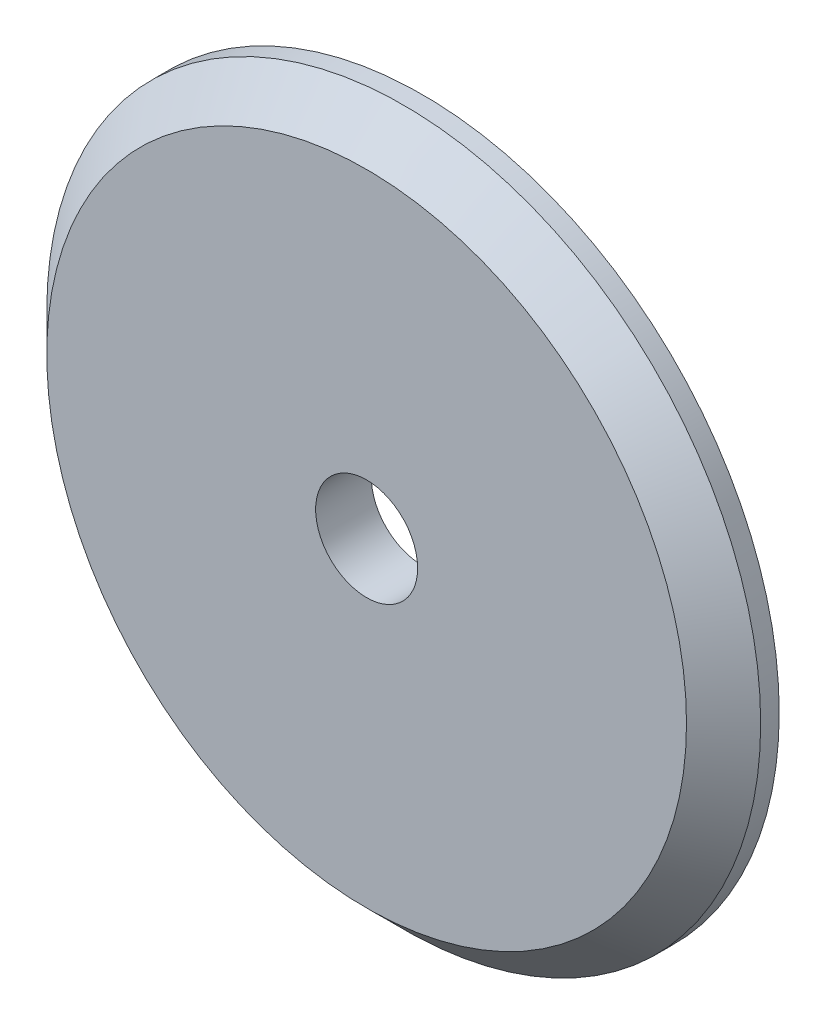
ISO-10303-21;
HEADER;
FILE_DESCRIPTION(('STEP AP214'),'2;1');
FILE_NAME('part.step','',(''),(''),'','','');
FILE_SCHEMA(('AUTOMOTIVE_DESIGN { 1 0 10303 214 1 1 1 1 }'));
ENDSEC;
DATA;
#1=APPLICATION_CONTEXT('core data for automotive mechanical design processes');
#2=APPLICATION_PROTOCOL_DEFINITION('international standard','automotive_design',2000,#1);
#3=PRODUCT_CONTEXT('',#1,'mechanical');
#4=PRODUCT('Part','Part','',(#3));
#5=PRODUCT_RELATED_PRODUCT_CATEGORY('part','',(#4));
#6=PRODUCT_DEFINITION_FORMATION('','',#4);
#7=PRODUCT_DEFINITION_CONTEXT('part definition',#1,'design');
#8=PRODUCT_DEFINITION('design','',#6,#7);
#9=PRODUCT_DEFINITION_SHAPE('','',#8);
#10=(LENGTH_UNIT() NAMED_UNIT(*) SI_UNIT(.MILLI.,.METRE.));
#11=(NAMED_UNIT(*) PLANE_ANGLE_UNIT() SI_UNIT($,.RADIAN.));
#12=(NAMED_UNIT(*) SI_UNIT($,.STERADIAN.) SOLID_ANGLE_UNIT());
#13=UNCERTAINTY_MEASURE_WITH_UNIT(LENGTH_MEASURE(1.E-05),#10,'distance_accuracy_value','');
#14=(GEOMETRIC_REPRESENTATION_CONTEXT(3) GLOBAL_UNCERTAINTY_ASSIGNED_CONTEXT((#13)) GLOBAL_UNIT_ASSIGNED_CONTEXT((#10,
#11,#12)) REPRESENTATION_CONTEXT('',''));
#15=CARTESIAN_POINT('',(0.,0.,0.));
#16=DIRECTION('',(0.,0.,1.));
#17=DIRECTION('',(1.,0.,0.));
#18=AXIS2_PLACEMENT_3D('',#15,#16,#17);
#19=CARTESIAN_POINT('',(0.,0.,0.));
#20=DIRECTION('',(0.,0.,1.));
#21=DIRECTION('',(1.,0.,0.));
#22=AXIS2_PLACEMENT_3D('',#19,#20,#21);
#23=PLANE('',#22);
#24=CARTESIAN_POINT('',(0.,0.,0.));
#25=DIRECTION('',(0.,0.,-1.));
#26=DIRECTION('',(-1.,0.,0.));
#27=AXIS2_PLACEMENT_3D('',#24,#25,#26);
#28=CIRCLE('',#27,3.4925);
#29=CARTESIAN_POINT('',(3.4925,0.,0.));
#30=VERTEX_POINT('',#29);
#31=EDGE_CURVE('E11',#30,#30,#28,.T.);
#32=ORIENTED_EDGE('',*,*,#31,.F.);
#33=EDGE_LOOP('',(#32));
#34=FACE_BOUND('',#33,.T.);
#35=CARTESIAN_POINT('',(0.,0.,0.));
#36=DIRECTION('',(0.,0.,1.));
#37=DIRECTION('',(1.,0.,0.));
#38=AXIS2_PLACEMENT_3D('',#35,#36,#37);
#39=CIRCLE('',#38,24.4475);
#40=CARTESIAN_POINT('',(-24.4475,0.,0.));
#41=VERTEX_POINT('',#40);
#42=EDGE_CURVE('E83',#41,#41,#39,.T.);
#43=ORIENTED_EDGE('',*,*,#42,.F.);
#44=EDGE_LOOP('',(#43));
#45=FACE_BOUND('',#44,.T.);
#46=ADVANCED_FACE('F17',(#34,#45),#23,.F.);
#47=CARTESIAN_POINT('',(0.,0.,0.));
#48=DIRECTION('',(0.,0.,1.));
#49=DIRECTION('',(-1.,0.,0.));
#50=AXIS2_PLACEMENT_3D('',#47,#48,#49);
#51=CYLINDRICAL_SURFACE('',#50,3.4925);
#52=CARTESIAN_POINT('',(0.,0.,3.81));
#53=DIRECTION('',(0.,0.,-1.));
#54=DIRECTION('',(-1.,0.,0.));
#55=AXIS2_PLACEMENT_3D('',#52,#53,#54);
#56=CIRCLE('',#55,3.4925);
#57=CARTESIAN_POINT('',(3.4925,0.,3.81));
#58=VERTEX_POINT('',#57);
#59=EDGE_CURVE('E86',#58,#58,#56,.T.);
#60=ORIENTED_EDGE('',*,*,#59,.F.);
#61=DIRECTION('',(0.,0.,-1.));
#62=VECTOR('',#61,1.);
#63=CARTESIAN_POINT('',(3.4925,0.,0.));
#64=LINE('',#63,#62);
#65=EDGE_CURVE('E25',#58,#30,#64,.T.);
#66=ORIENTED_EDGE('',*,*,#65,.T.);
#67=ORIENTED_EDGE('',*,*,#31,.T.);
#68=ORIENTED_EDGE('',*,*,#65,.F.);
#69=EDGE_LOOP('',(#60,#66,#67,#68));
#70=FACE_BOUND('',#69,.T.);
#71=ADVANCED_FACE('F90',(#70),#51,.F.);
#72=CARTESIAN_POINT('',(0.,0.,3.81));
#73=DIRECTION('',(0.,0.,1.));
#74=DIRECTION('',(1.,0.,0.));
#75=AXIS2_PLACEMENT_3D('',#72,#73,#74);
#76=PLANE('',#75);
#77=ORIENTED_EDGE('',*,*,#59,.T.);
#78=EDGE_LOOP('',(#77));
#79=FACE_BOUND('',#78,.T.);
#80=CARTESIAN_POINT('',(0.,0.,3.81));
#81=DIRECTION('',(0.,0.,-1.));
#82=DIRECTION('',(-1.,0.,0.));
#83=AXIS2_PLACEMENT_3D('',#80,#81,#82);
#84=CIRCLE('',#83,21.9075);
#85=CARTESIAN_POINT('',(21.9075,0.,3.81));
#86=VERTEX_POINT('',#85);
#87=EDGE_CURVE('E63',#86,#86,#84,.T.);
#88=ORIENTED_EDGE('',*,*,#87,.F.);
#89=EDGE_LOOP('',(#88));
#90=FACE_BOUND('',#89,.T.);
#91=ADVANCED_FACE('F92',(#79,#90),#76,.T.);
#92=CARTESIAN_POINT('',(0.,0.,0.));
#93=DIRECTION('',(0.,0.,1.));
#94=DIRECTION('',(1.,0.,0.));
#95=AXIS2_PLACEMENT_3D('',#92,#93,#94);
#96=CYLINDRICAL_SURFACE('',#95,24.4475);
#97=CARTESIAN_POINT('',(0.,0.,1.27));
#98=DIRECTION('',(0.,0.,1.));
#99=DIRECTION('',(-1.,0.,0.));
#100=AXIS2_PLACEMENT_3D('',#97,#98,#99);
#101=CIRCLE('',#100,24.4475);
#102=CARTESIAN_POINT('',(24.4475,0.,1.27));
#103=VERTEX_POINT('',#102);
#104=CARTESIAN_POINT('',(-24.4475,0.,1.27));
#105=VERTEX_POINT('',#104);
#106=EDGE_CURVE('E69',#103,#105,#101,.T.);
#107=ORIENTED_EDGE('',*,*,#106,.F.);
#108=CARTESIAN_POINT('',(0.,0.,1.27));
#109=DIRECTION('',(0.,0.,1.));
#110=DIRECTION('',(-1.,0.,0.));
#111=AXIS2_PLACEMENT_3D('',#108,#109,#110);
#112=CIRCLE('',#111,24.4475);
#113=EDGE_CURVE('E66',#105,#103,#112,.T.);
#114=ORIENTED_EDGE('',*,*,#113,.F.);
#115=DIRECTION('',(0.,0.,-1.));
#116=VECTOR('',#115,1.);
#117=CARTESIAN_POINT('',(-24.4475,0.,0.));
#118=LINE('',#117,#116);
#119=EDGE_CURVE('E79',#105,#41,#118,.T.);
#120=ORIENTED_EDGE('',*,*,#119,.T.);
#121=ORIENTED_EDGE('',*,*,#42,.T.);
#122=ORIENTED_EDGE('',*,*,#119,.F.);
#123=EDGE_LOOP('',(#107,#114,#120,#121,#122));
#124=FACE_BOUND('',#123,.T.);
#125=ADVANCED_FACE('F95',(#124),#96,.T.);
#126=CARTESIAN_POINT('',(0.,0.,2.54));
#127=DIRECTION('',(0.,0.,-1.));
#128=DIRECTION('',(-1.,0.,0.));
#129=AXIS2_PLACEMENT_3D('',#126,#127,#128);
#130=CONICAL_SURFACE('',#129,23.1775,0.785398163397448);
#131=ORIENTED_EDGE('',*,*,#87,.T.);
#132=DIRECTION('',(0.707106781186548,0.,-0.707106781186548));
#133=VECTOR('',#132,1.);
#134=CARTESIAN_POINT('',(23.1775,0.,2.54));
#135=LINE('',#134,#133);
#136=EDGE_CURVE('E60',#86,#103,#135,.T.);
#137=ORIENTED_EDGE('',*,*,#136,.T.);
#138=ORIENTED_EDGE('',*,*,#106,.T.);
#139=ORIENTED_EDGE('',*,*,#113,.T.);
#140=ORIENTED_EDGE('',*,*,#136,.F.);
#141=EDGE_LOOP('',(#131,#137,#138,#139,#140));
#142=FACE_BOUND('',#141,.T.);
#143=ADVANCED_FACE('F61',(#142),#130,.T.);
#144=CLOSED_SHELL('',(#46,#71,#91,#125,#143));
#145=MANIFOLD_SOLID_BREP('B1',#144);
#146=ADVANCED_BREP_SHAPE_REPRESENTATION('',(#18,#145),#14);
#147=SHAPE_DEFINITION_REPRESENTATION(#9,#146);
ENDSEC;
END-ISO-10303-21;
